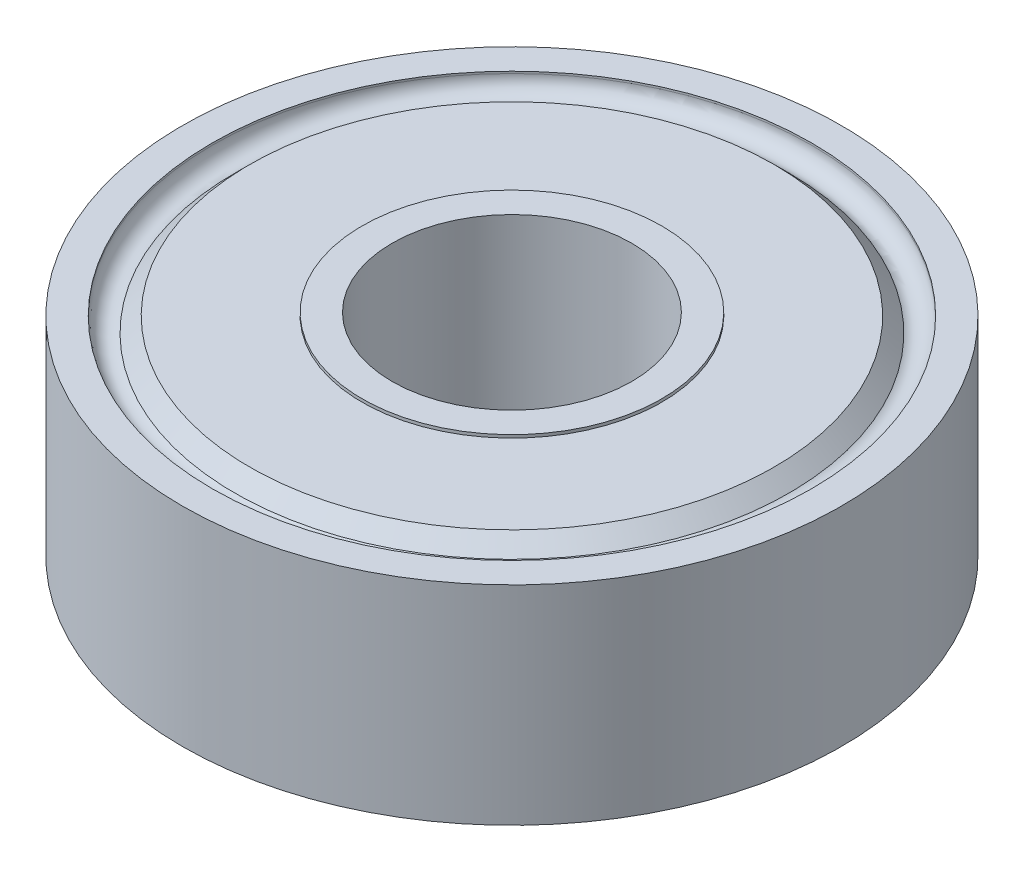
ISO-10303-21;
HEADER;
FILE_DESCRIPTION(('STEP AP214'),'2;1');
FILE_NAME('part.step','',(''),(''),'','','');
FILE_SCHEMA(('AUTOMOTIVE_DESIGN { 1 0 10303 214 1 1 1 1 }'));
ENDSEC;
DATA;
#1=APPLICATION_CONTEXT('core data for automotive mechanical design processes');
#2=APPLICATION_PROTOCOL_DEFINITION('international standard','automotive_design',2000,#1);
#3=PRODUCT_CONTEXT('',#1,'mechanical');
#4=PRODUCT('Part','Part','',(#3));
#5=PRODUCT_RELATED_PRODUCT_CATEGORY('part','',(#4));
#6=PRODUCT_DEFINITION_FORMATION('','',#4);
#7=PRODUCT_DEFINITION_CONTEXT('part definition',#1,'design');
#8=PRODUCT_DEFINITION('design','',#6,#7);
#9=PRODUCT_DEFINITION_SHAPE('','',#8);
#10=(LENGTH_UNIT() NAMED_UNIT(*) SI_UNIT(.MILLI.,.METRE.));
#11=(NAMED_UNIT(*) PLANE_ANGLE_UNIT() SI_UNIT($,.RADIAN.));
#12=(NAMED_UNIT(*) SI_UNIT($,.STERADIAN.) SOLID_ANGLE_UNIT());
#13=UNCERTAINTY_MEASURE_WITH_UNIT(LENGTH_MEASURE(1.E-05),#10,'distance_accuracy_value','');
#14=(GEOMETRIC_REPRESENTATION_CONTEXT(3) GLOBAL_UNCERTAINTY_ASSIGNED_CONTEXT((#13)) GLOBAL_UNIT_ASSIGNED_CONTEXT((#10,
#11,#12)) REPRESENTATION_CONTEXT('',''));
#15=CARTESIAN_POINT('',(0.,0.,0.));
#16=DIRECTION('',(0.,0.,1.));
#17=DIRECTION('',(1.,0.,0.));
#18=AXIS2_PLACEMENT_3D('',#15,#16,#17);
#19=CARTESIAN_POINT('',(0.,3.475,0.));
#20=DIRECTION('',(0.,-1.,0.));
#21=DIRECTION('',(0.,0.,-1.));
#22=AXIS2_PLACEMENT_3D('',#19,#20,#21);
#23=CYLINDRICAL_SURFACE('',#22,11.);
#24=CARTESIAN_POINT('',(0.,0.,0.));
#25=DIRECTION('',(0.,1.,0.));
#26=DIRECTION('',(0.,0.,1.));
#27=AXIS2_PLACEMENT_3D('',#24,#25,#26);
#28=CIRCLE('',#27,11.);
#29=CARTESIAN_POINT('',(0.,0.,11.));
#30=VERTEX_POINT('',#29);
#31=EDGE_CURVE('E75',#30,#30,#28,.T.);
#32=ORIENTED_EDGE('',*,*,#31,.T.);
#33=EDGE_LOOP('',(#32));
#34=FACE_BOUND('',#33,.T.);
#35=CARTESIAN_POINT('',(0.,6.95,0.));
#36=DIRECTION('',(0.,1.,0.));
#37=DIRECTION('',(0.,0.,1.));
#38=AXIS2_PLACEMENT_3D('',#35,#36,#37);
#39=CIRCLE('',#38,11.);
#40=CARTESIAN_POINT('',(0.,6.95,11.));
#41=VERTEX_POINT('',#40);
#42=EDGE_CURVE('E87',#41,#41,#39,.T.);
#43=ORIENTED_EDGE('',*,*,#42,.F.);
#44=EDGE_LOOP('',(#43));
#45=FACE_BOUND('',#44,.T.);
#46=ADVANCED_FACE('F46',(#34,#45),#23,.T.);
#47=CARTESIAN_POINT('',(0.,0.,0.));
#48=DIRECTION('',(0.,1.,0.));
#49=DIRECTION('',(0.,0.,1.));
#50=AXIS2_PLACEMENT_3D('',#47,#48,#49);
#51=PLANE('',#50);
#52=CARTESIAN_POINT('',(0.,0.,0.));
#53=DIRECTION('',(0.,-1.,0.));
#54=DIRECTION('',(0.,0.,-1.));
#55=AXIS2_PLACEMENT_3D('',#52,#53,#54);
#56=CIRCLE('',#55,10.);
#57=CARTESIAN_POINT('',(0.,0.,-10.));
#58=VERTEX_POINT('',#57);
#59=EDGE_CURVE('E78',#58,#58,#56,.T.);
#60=ORIENTED_EDGE('',*,*,#59,.F.);
#61=EDGE_LOOP('',(#60));
#62=FACE_BOUND('',#61,.T.);
#63=ORIENTED_EDGE('',*,*,#31,.F.);
#64=EDGE_LOOP('',(#63));
#65=FACE_BOUND('',#64,.T.);
#66=ADVANCED_FACE('F134',(#62,#65),#51,.F.);
#67=CARTESIAN_POINT('',(0.,0.5,0.));
#68=DIRECTION('',(0.,-1.,0.));
#69=DIRECTION('',(0.,0.,-1.));
#70=AXIS2_PLACEMENT_3D('',#67,#68,#69);
#71=CYLINDRICAL_SURFACE('',#70,10.);
#72=CARTESIAN_POINT('',(0.,0.0669872981077808,0.));
#73=DIRECTION('',(0.,1.,0.));
#74=DIRECTION('',(0.,0.,1.));
#75=AXIS2_PLACEMENT_3D('',#72,#73,#74);
#76=CIRCLE('',#75,10.);
#77=CARTESIAN_POINT('',(0.,0.0669872981077808,10.));
#78=VERTEX_POINT('',#77);
#79=EDGE_CURVE('E72',#78,#78,#76,.T.);
#80=ORIENTED_EDGE('',*,*,#79,.T.);
#81=EDGE_LOOP('',(#80));
#82=FACE_BOUND('',#81,.T.);
#83=ORIENTED_EDGE('',*,*,#59,.T.);
#84=EDGE_LOOP('',(#83));
#85=FACE_BOUND('',#84,.T.);
#86=ADVANCED_FACE('F140',(#82,#85),#71,.F.);
#87=CARTESIAN_POINT('',(0.,0.,0.));
#88=DIRECTION('',(0.,1.,0.));
#89=DIRECTION('',(0.,0.,1.));
#90=AXIS2_PLACEMENT_3D('',#87,#88,#89);
#91=CIRCLE('',#90,5.);
#92=CARTESIAN_POINT('',(0.,0.,5.));
#93=VERTEX_POINT('',#92);
#94=EDGE_CURVE('E61',#93,#93,#91,.F.);
#95=ORIENTED_EDGE('',*,*,#94,.F.);
#96=EDGE_LOOP('',(#95));
#97=FACE_BOUND('',#96,.T.);
#98=CARTESIAN_POINT('',(0.,0.,0.));
#99=DIRECTION('',(0.,1.,0.));
#100=DIRECTION('',(0.,0.,1.));
#101=AXIS2_PLACEMENT_3D('',#98,#99,#100);
#102=CIRCLE('',#101,8.74999999999998);
#103=CARTESIAN_POINT('',(0.,0.,8.74999999999998));
#104=VERTEX_POINT('',#103);
#105=EDGE_CURVE('E69',#104,#104,#102,.F.);
#106=ORIENTED_EDGE('',*,*,#105,.T.);
#107=EDGE_LOOP('',(#106));
#108=FACE_BOUND('',#107,.T.);
#109=ADVANCED_FACE('F143',(#97,#108),#51,.F.);
#110=CARTESIAN_POINT('',(0.,0.0669872981077808,0.));
#111=DIRECTION('',(0.,1.,0.));
#112=DIRECTION('',(0.,0.,1.));
#113=AXIS2_PLACEMENT_3D('',#110,#111,#112);
#114=TOROIDAL_SURFACE('',#113,9.5,0.5);
#115=CARTESIAN_POINT('',(0.,0.499999999999952,0.));
#116=DIRECTION('',(0.,1.,0.));
#117=DIRECTION('',(0.,0.,1.));
#118=AXIS2_PLACEMENT_3D('',#115,#116,#117);
#119=CIRCLE('',#118,9.24999999999994);
#120=CARTESIAN_POINT('',(0.,0.499999999999952,9.24999999999994));
#121=VERTEX_POINT('',#120);
#122=EDGE_CURVE('E66',#121,#121,#119,.T.);
#123=ORIENTED_EDGE('',*,*,#122,.T.);
#124=EDGE_LOOP('',(#123));
#125=FACE_BOUND('',#124,.T.);
#126=ORIENTED_EDGE('',*,*,#79,.F.);
#127=EDGE_LOOP('',(#126));
#128=FACE_BOUND('',#127,.T.);
#129=ADVANCED_FACE('F147',(#125,#128),#114,.F.);
#130=CARTESIAN_POINT('',(0.,0.,0.));
#131=DIRECTION('',(0.,1.,0.));
#132=DIRECTION('',(0.,0.,1.));
#133=AXIS2_PLACEMENT_3D('',#130,#131,#132);
#134=CONICAL_SURFACE('',#133,8.74999999999998,0.785398163397454);
#135=ORIENTED_EDGE('',*,*,#122,.F.);
#136=EDGE_LOOP('',(#135));
#137=FACE_BOUND('',#136,.T.);
#138=ORIENTED_EDGE('',*,*,#105,.F.);
#139=EDGE_LOOP('',(#138));
#140=FACE_BOUND('',#139,.T.);
#141=ADVANCED_FACE('F150',(#137,#140),#134,.T.);
#142=CARTESIAN_POINT('',(0.,3.475,0.));
#143=DIRECTION('',(0.,-1.,0.));
#144=DIRECTION('',(0.,0.,-1.));
#145=AXIS2_PLACEMENT_3D('',#142,#143,#144);
#146=CYLINDRICAL_SURFACE('',#145,4.);
#147=CARTESIAN_POINT('',(0.,-0.1,0.));
#148=DIRECTION('',(0.,-1.,0.));
#149=DIRECTION('',(0.,0.,-1.));
#150=AXIS2_PLACEMENT_3D('',#147,#148,#149);
#151=CIRCLE('',#150,4.);
#152=CARTESIAN_POINT('',(0.,-0.1,-4.));
#153=VERTEX_POINT('',#152);
#154=EDGE_CURVE('E84',#153,#153,#151,.T.);
#155=ORIENTED_EDGE('',*,*,#154,.T.);
#156=EDGE_LOOP('',(#155));
#157=FACE_BOUND('',#156,.T.);
#158=CARTESIAN_POINT('',(0.,7.05,0.));
#159=DIRECTION('',(0.,1.,0.));
#160=DIRECTION('',(0.,0.,1.));
#161=AXIS2_PLACEMENT_3D('',#158,#159,#160);
#162=CIRCLE('',#161,4.);
#163=CARTESIAN_POINT('',(0.,7.05,4.));
#164=VERTEX_POINT('',#163);
#165=EDGE_CURVE('E97',#164,#164,#162,.T.);
#166=ORIENTED_EDGE('',*,*,#165,.T.);
#167=EDGE_LOOP('',(#166));
#168=FACE_BOUND('',#167,.T.);
#169=ADVANCED_FACE('F103',(#157,#168),#146,.F.);
#170=CARTESIAN_POINT('',(0.,-0.1,0.));
#171=DIRECTION('',(0.,1.,0.));
#172=DIRECTION('',(0.,0.,1.));
#173=AXIS2_PLACEMENT_3D('',#170,#171,#172);
#174=CYLINDRICAL_SURFACE('',#173,5.);
#175=CARTESIAN_POINT('',(0.,-0.1,0.));
#176=DIRECTION('',(0.,-1.,0.));
#177=DIRECTION('',(0.,0.,-1.));
#178=AXIS2_PLACEMENT_3D('',#175,#176,#177);
#179=CIRCLE('',#178,5.);
#180=CARTESIAN_POINT('',(0.,-0.1,-5.));
#181=VERTEX_POINT('',#180);
#182=EDGE_CURVE('E81',#181,#181,#179,.T.);
#183=ORIENTED_EDGE('',*,*,#182,.F.);
#184=EDGE_LOOP('',(#183));
#185=FACE_BOUND('',#184,.T.);
#186=ORIENTED_EDGE('',*,*,#94,.T.);
#187=EDGE_LOOP('',(#186));
#188=FACE_BOUND('',#187,.T.);
#189=ADVANCED_FACE('F157',(#185,#188),#174,.T.);
#190=CARTESIAN_POINT('',(0.,-0.1,0.));
#191=DIRECTION('',(0.,-1.,0.));
#192=DIRECTION('',(0.,0.,-1.));
#193=AXIS2_PLACEMENT_3D('',#190,#191,#192);
#194=PLANE('',#193);
#195=ORIENTED_EDGE('',*,*,#154,.F.);
#196=EDGE_LOOP('',(#195));
#197=FACE_BOUND('',#196,.T.);
#198=ORIENTED_EDGE('',*,*,#182,.T.);
#199=EDGE_LOOP('',(#198));
#200=FACE_BOUND('',#199,.T.);
#201=ADVANCED_FACE('F131',(#197,#200),#194,.T.);
#202=CARTESIAN_POINT('',(0.,6.95,0.));
#203=DIRECTION('',(0.,-1.,0.));
#204=DIRECTION('',(0.,0.,1.));
#205=AXIS2_PLACEMENT_3D('',#202,#203,#204);
#206=PLANE('',#205);
#207=CARTESIAN_POINT('',(0.,6.95,0.));
#208=DIRECTION('',(0.,-1.,0.));
#209=DIRECTION('',(0.,0.,-1.));
#210=AXIS2_PLACEMENT_3D('',#207,#208,#209);
#211=CIRCLE('',#210,10.);
#212=CARTESIAN_POINT('',(0.,6.95,-10.));
#213=VERTEX_POINT('',#212);
#214=EDGE_CURVE('E90',#213,#213,#211,.T.);
#215=ORIENTED_EDGE('',*,*,#214,.T.);
#216=EDGE_LOOP('',(#215));
#217=FACE_BOUND('',#216,.T.);
#218=ORIENTED_EDGE('',*,*,#42,.T.);
#219=EDGE_LOOP('',(#218));
#220=FACE_BOUND('',#219,.T.);
#221=ADVANCED_FACE('F122',(#217,#220),#206,.F.);
#222=CARTESIAN_POINT('',(0.,6.45,0.));
#223=DIRECTION('',(0.,1.,0.));
#224=DIRECTION('',(0.,0.,1.));
#225=AXIS2_PLACEMENT_3D('',#222,#223,#224);
#226=CYLINDRICAL_SURFACE('',#225,10.);
#227=CARTESIAN_POINT('',(0.,6.88301270189222,0.));
#228=DIRECTION('',(0.,-1.,0.));
#229=DIRECTION('',(0.,0.,-1.));
#230=AXIS2_PLACEMENT_3D('',#227,#228,#229);
#231=CIRCLE('',#230,10.);
#232=CARTESIAN_POINT('',(0.,6.88301270189222,-10.));
#233=VERTEX_POINT('',#232);
#234=EDGE_CURVE('E57',#233,#233,#231,.T.);
#235=ORIENTED_EDGE('',*,*,#234,.T.);
#236=EDGE_LOOP('',(#235));
#237=FACE_BOUND('',#236,.T.);
#238=ORIENTED_EDGE('',*,*,#214,.F.);
#239=EDGE_LOOP('',(#238));
#240=FACE_BOUND('',#239,.T.);
#241=ADVANCED_FACE('F120',(#237,#240),#226,.F.);
#242=CARTESIAN_POINT('',(0.,6.95,0.));
#243=DIRECTION('',(0.,-1.,0.));
#244=DIRECTION('',(0.,0.,-1.));
#245=AXIS2_PLACEMENT_3D('',#242,#243,#244);
#246=CIRCLE('',#245,5.);
#247=CARTESIAN_POINT('',(0.,6.95,-5.));
#248=VERTEX_POINT('',#247);
#249=EDGE_CURVE('E94',#248,#248,#246,.T.);
#250=ORIENTED_EDGE('',*,*,#249,.T.);
#251=EDGE_LOOP('',(#250));
#252=FACE_BOUND('',#251,.T.);
#253=CARTESIAN_POINT('',(0.,6.95,0.));
#254=DIRECTION('',(0.,-1.,0.));
#255=DIRECTION('',(0.,0.,-1.));
#256=AXIS2_PLACEMENT_3D('',#253,#254,#255);
#257=CIRCLE('',#256,8.74999999999999);
#258=CARTESIAN_POINT('',(0.,6.95,-8.74999999999999));
#259=VERTEX_POINT('',#258);
#260=EDGE_CURVE('E53',#259,#259,#257,.F.);
#261=ORIENTED_EDGE('',*,*,#260,.T.);
#262=EDGE_LOOP('',(#261));
#263=FACE_BOUND('',#262,.T.);
#264=ADVANCED_FACE('F117',(#252,#263),#206,.F.);
#265=CARTESIAN_POINT('',(0.,6.88301270189222,0.));
#266=DIRECTION('',(0.,-1.,0.));
#267=DIRECTION('',(0.,0.,-1.));
#268=AXIS2_PLACEMENT_3D('',#265,#266,#267);
#269=TOROIDAL_SURFACE('',#268,9.5,0.5);
#270=CARTESIAN_POINT('',(0.,6.44999999999998,0.));
#271=DIRECTION('',(0.,-1.,0.));
#272=DIRECTION('',(0.,0.,-1.));
#273=AXIS2_PLACEMENT_3D('',#270,#271,#272);
#274=CIRCLE('',#273,9.25000000000001);
#275=CARTESIAN_POINT('',(0.,6.44999999999998,-9.25000000000001));
#276=VERTEX_POINT('',#275);
#277=EDGE_CURVE('E12',#276,#276,#274,.T.);
#278=ORIENTED_EDGE('',*,*,#277,.T.);
#279=EDGE_LOOP('',(#278));
#280=FACE_BOUND('',#279,.T.);
#281=ORIENTED_EDGE('',*,*,#234,.F.);
#282=EDGE_LOOP('',(#281));
#283=FACE_BOUND('',#282,.T.);
#284=ADVANCED_FACE('F119',(#280,#283),#269,.F.);
#285=CARTESIAN_POINT('',(0.,5.94999999999998,0.));
#286=DIRECTION('',(0.,-1.,0.));
#287=DIRECTION('',(0.,0.,-1.));
#288=AXIS2_PLACEMENT_3D('',#285,#286,#287);
#289=CONICAL_SURFACE('',#288,9.75,0.785398163397444);
#290=ORIENTED_EDGE('',*,*,#260,.F.);
#291=EDGE_LOOP('',(#290));
#292=FACE_BOUND('',#291,.T.);
#293=ORIENTED_EDGE('',*,*,#277,.F.);
#294=EDGE_LOOP('',(#293));
#295=FACE_BOUND('',#294,.T.);
#296=ADVANCED_FACE('F48',(#292,#295),#289,.T.);
#297=CARTESIAN_POINT('',(0.,7.05,0.));
#298=DIRECTION('',(0.,1.,0.));
#299=DIRECTION('',(0.,0.,-1.));
#300=AXIS2_PLACEMENT_3D('',#297,#298,#299);
#301=PLANE('',#300);
#302=ORIENTED_EDGE('',*,*,#165,.F.);
#303=EDGE_LOOP('',(#302));
#304=FACE_BOUND('',#303,.T.);
#305=CARTESIAN_POINT('',(0.,7.05,0.));
#306=DIRECTION('',(0.,-1.,0.));
#307=DIRECTION('',(0.,0.,-1.));
#308=AXIS2_PLACEMENT_3D('',#305,#306,#307);
#309=CIRCLE('',#308,5.);
#310=CARTESIAN_POINT('',(0.,7.05,-5.));
#311=VERTEX_POINT('',#310);
#312=EDGE_CURVE('E93',#311,#311,#309,.T.);
#313=ORIENTED_EDGE('',*,*,#312,.F.);
#314=EDGE_LOOP('',(#313));
#315=FACE_BOUND('',#314,.T.);
#316=ADVANCED_FACE('F105',(#304,#315),#301,.T.);
#317=CARTESIAN_POINT('',(0.,7.05,0.));
#318=DIRECTION('',(0.,-1.,0.));
#319=DIRECTION('',(0.,0.,-1.));
#320=AXIS2_PLACEMENT_3D('',#317,#318,#319);
#321=CYLINDRICAL_SURFACE('',#320,5.);
#322=ORIENTED_EDGE('',*,*,#312,.T.);
#323=EDGE_LOOP('',(#322));
#324=FACE_BOUND('',#323,.T.);
#325=ORIENTED_EDGE('',*,*,#249,.F.);
#326=EDGE_LOOP('',(#325));
#327=FACE_BOUND('',#326,.T.);
#328=ADVANCED_FACE('F108',(#324,#327),#321,.T.);
#329=CLOSED_SHELL('',(#46,#66,#86,#109,#129,#141,#169,#189,#201,#221,#241,#264,#284,#296,#316,#328));
#330=MANIFOLD_SOLID_BREP('B2',#329);
#331=ADVANCED_BREP_SHAPE_REPRESENTATION('',(#18,#330),#14);
#332=SHAPE_DEFINITION_REPRESENTATION(#9,#331);
ENDSEC;
END-ISO-10303-21;
